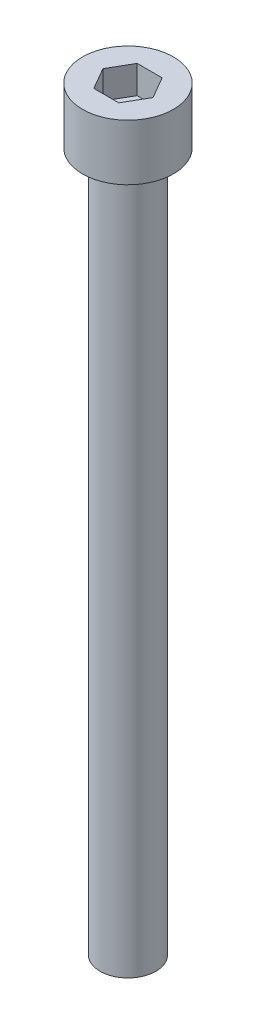
ISO-10303-21;
HEADER;
FILE_DESCRIPTION(('STEP AP214'),'2;1');
FILE_NAME('part.step','',(''),(''),'','','');
FILE_SCHEMA(('AUTOMOTIVE_DESIGN { 1 0 10303 214 1 1 1 1 }'));
ENDSEC;
DATA;
#1=APPLICATION_CONTEXT('core data for automotive mechanical design processes');
#2=APPLICATION_PROTOCOL_DEFINITION('international standard','automotive_design',2000,#1);
#3=PRODUCT_CONTEXT('',#1,'mechanical');
#4=PRODUCT('Part','Part','',(#3));
#5=PRODUCT_RELATED_PRODUCT_CATEGORY('part','',(#4));
#6=PRODUCT_DEFINITION_FORMATION('','',#4);
#7=PRODUCT_DEFINITION_CONTEXT('part definition',#1,'design');
#8=PRODUCT_DEFINITION('design','',#6,#7);
#9=PRODUCT_DEFINITION_SHAPE('','',#8);
#10=(LENGTH_UNIT() NAMED_UNIT(*) SI_UNIT(.MILLI.,.METRE.));
#11=(NAMED_UNIT(*) PLANE_ANGLE_UNIT() SI_UNIT($,.RADIAN.));
#12=(NAMED_UNIT(*) SI_UNIT($,.STERADIAN.) SOLID_ANGLE_UNIT());
#13=UNCERTAINTY_MEASURE_WITH_UNIT(LENGTH_MEASURE(1.E-05),#10,'distance_accuracy_value','');
#14=(GEOMETRIC_REPRESENTATION_CONTEXT(3) GLOBAL_UNCERTAINTY_ASSIGNED_CONTEXT((#13)) GLOBAL_UNIT_ASSIGNED_CONTEXT((#10,
#11,#12)) REPRESENTATION_CONTEXT('',''));
#15=CARTESIAN_POINT('',(0.,0.,0.));
#16=DIRECTION('',(0.,0.,1.));
#17=DIRECTION('',(1.,0.,0.));
#18=AXIS2_PLACEMENT_3D('',#15,#16,#17);
#19=CARTESIAN_POINT('',(0.,8.,0.));
#20=DIRECTION('',(0.,-1.,0.));
#21=DIRECTION('',(0.,0.,-1.));
#22=AXIS2_PLACEMENT_3D('',#19,#20,#21);
#23=CYLINDRICAL_SURFACE('',#22,6.5);
#24=CARTESIAN_POINT('',(0.,8.,0.));
#25=DIRECTION('',(0.,1.,0.));
#26=DIRECTION('',(0.,0.,1.));
#27=AXIS2_PLACEMENT_3D('',#24,#25,#26);
#28=CIRCLE('',#27,6.5);
#29=CARTESIAN_POINT('',(0.,8.,6.5));
#30=VERTEX_POINT('',#29);
#31=EDGE_CURVE('E45',#30,#30,#28,.T.);
#32=ORIENTED_EDGE('',*,*,#31,.F.);
#33=EDGE_LOOP('',(#32));
#34=FACE_BOUND('',#33,.T.);
#35=CARTESIAN_POINT('',(0.,0.,0.));
#36=DIRECTION('',(0.,1.,0.));
#37=DIRECTION('',(0.,0.,1.));
#38=AXIS2_PLACEMENT_3D('',#35,#36,#37);
#39=CIRCLE('',#38,6.5);
#40=CARTESIAN_POINT('',(0.,0.,6.5));
#41=VERTEX_POINT('',#40);
#42=EDGE_CURVE('E40',#41,#41,#39,.T.);
#43=ORIENTED_EDGE('',*,*,#42,.T.);
#44=EDGE_LOOP('',(#43));
#45=FACE_BOUND('',#44,.T.);
#46=ADVANCED_FACE('F37',(#34,#45),#23,.T.);
#47=CARTESIAN_POINT('',(0.,8.,0.));
#48=DIRECTION('',(0.,1.,0.));
#49=DIRECTION('',(0.,0.,1.));
#50=AXIS2_PLACEMENT_3D('',#47,#48,#49);
#51=PLANE('',#50);
#52=DIRECTION('',(0.5,0.,-0.866025403784439));
#53=VECTOR('',#52,1.);
#54=CARTESIAN_POINT('',(1.78978583448784,8.,3.1));
#55=LINE('',#54,#53);
#56=CARTESIAN_POINT('',(1.78978583448784,8.,3.1));
#57=VERTEX_POINT('',#56);
#58=CARTESIAN_POINT('',(3.57957166897568,8.,0.));
#59=VERTEX_POINT('',#58);
#60=EDGE_CURVE('E53',#57,#59,#55,.T.);
#61=ORIENTED_EDGE('',*,*,#60,.F.);
#62=DIRECTION('',(1.,0.,0.));
#63=VECTOR('',#62,1.);
#64=CARTESIAN_POINT('',(-1.78978583448784,8.,3.1));
#65=LINE('',#64,#63);
#66=CARTESIAN_POINT('',(-1.78978583448784,8.,3.1));
#67=VERTEX_POINT('',#66);
#68=EDGE_CURVE('E137',#67,#57,#65,.T.);
#69=ORIENTED_EDGE('',*,*,#68,.F.);
#70=DIRECTION('',(0.5,0.,0.866025403784439));
#71=VECTOR('',#70,1.);
#72=CARTESIAN_POINT('',(-3.57957166897568,8.,0.));
#73=LINE('',#72,#71);
#74=CARTESIAN_POINT('',(-3.57957166897568,8.,0.));
#75=VERTEX_POINT('',#74);
#76=EDGE_CURVE('E135',#75,#67,#73,.T.);
#77=ORIENTED_EDGE('',*,*,#76,.F.);
#78=DIRECTION('',(-0.5,0.,0.866025403784439));
#79=VECTOR('',#78,1.);
#80=CARTESIAN_POINT('',(-1.78978583448784,8.,-3.1));
#81=LINE('',#80,#79);
#82=CARTESIAN_POINT('',(-1.78978583448784,8.,-3.1));
#83=VERTEX_POINT('',#82);
#84=EDGE_CURVE('E101',#83,#75,#81,.T.);
#85=ORIENTED_EDGE('',*,*,#84,.F.);
#86=DIRECTION('',(-1.,0.,0.));
#87=VECTOR('',#86,1.);
#88=CARTESIAN_POINT('',(1.78978583448784,8.,-3.1));
#89=LINE('',#88,#87);
#90=CARTESIAN_POINT('',(1.78978583448784,8.,-3.1));
#91=VERTEX_POINT('',#90);
#92=EDGE_CURVE('E131',#91,#83,#89,.T.);
#93=ORIENTED_EDGE('',*,*,#92,.F.);
#94=DIRECTION('',(-0.5,0.,-0.866025403784439));
#95=VECTOR('',#94,1.);
#96=CARTESIAN_POINT('',(3.57957166897568,8.,0.));
#97=LINE('',#96,#95);
#98=EDGE_CURVE('E127',#59,#91,#97,.T.);
#99=ORIENTED_EDGE('',*,*,#98,.F.);
#100=EDGE_LOOP('',(#61,#69,#77,#85,#93,#99));
#101=FACE_BOUND('',#100,.T.);
#102=ORIENTED_EDGE('',*,*,#31,.T.);
#103=EDGE_LOOP('',(#102));
#104=FACE_BOUND('',#103,.T.);
#105=ADVANCED_FACE('F155',(#101,#104),#51,.T.);
#106=CARTESIAN_POINT('',(0.,0.,0.));
#107=DIRECTION('',(0.,1.,0.));
#108=DIRECTION('',(0.,0.,1.));
#109=AXIS2_PLACEMENT_3D('',#106,#107,#108);
#110=PLANE('',#109);
#111=CARTESIAN_POINT('',(0.,0.,0.));
#112=DIRECTION('',(0.,-1.,0.));
#113=DIRECTION('',(0.,0.,-1.));
#114=AXIS2_PLACEMENT_3D('',#111,#112,#113);
#115=CIRCLE('',#114,4.);
#116=CARTESIAN_POINT('',(0.,0.,-4.));
#117=VERTEX_POINT('',#116);
#118=EDGE_CURVE('E11',#117,#117,#115,.T.);
#119=ORIENTED_EDGE('',*,*,#118,.F.);
#120=EDGE_LOOP('',(#119));
#121=FACE_BOUND('',#120,.T.);
#122=ORIENTED_EDGE('',*,*,#42,.F.);
#123=EDGE_LOOP('',(#122));
#124=FACE_BOUND('',#123,.T.);
#125=ADVANCED_FACE('F152',(#121,#124),#110,.F.);
#126=CARTESIAN_POINT('',(1.78978583448784,4.,3.1));
#127=DIRECTION('',(0.866025403784439,0.,0.5));
#128=DIRECTION('',(0.5,0.,-0.866025403784439));
#129=AXIS2_PLACEMENT_3D('',#126,#127,#128);
#130=PLANE('',#129);
#131=ORIENTED_EDGE('',*,*,#60,.T.);
#132=DIRECTION('',(0.,1.,0.));
#133=VECTOR('',#132,1.);
#134=CARTESIAN_POINT('',(3.57957166897568,4.,0.));
#135=LINE('',#134,#133);
#136=CARTESIAN_POINT('',(3.57957166897568,4.,0.));
#137=VERTEX_POINT('',#136);
#138=EDGE_CURVE('E83',#137,#59,#135,.T.);
#139=ORIENTED_EDGE('',*,*,#138,.F.);
#140=DIRECTION('',(0.5,0.,-0.866025403784439));
#141=VECTOR('',#140,1.);
#142=CARTESIAN_POINT('',(1.78978583448784,4.,3.1));
#143=LINE('',#142,#141);
#144=CARTESIAN_POINT('',(1.78978583448784,4.,3.1));
#145=VERTEX_POINT('',#144);
#146=EDGE_CURVE('E139',#145,#137,#143,.T.);
#147=ORIENTED_EDGE('',*,*,#146,.F.);
#148=DIRECTION('',(0.,1.,0.));
#149=VECTOR('',#148,1.);
#150=CARTESIAN_POINT('',(1.78978583448784,4.,3.1));
#151=LINE('',#150,#149);
#152=EDGE_CURVE('E61',#145,#57,#151,.T.);
#153=ORIENTED_EDGE('',*,*,#152,.T.);
#154=EDGE_LOOP('',(#131,#139,#147,#153));
#155=FACE_BOUND('',#154,.T.);
#156=ADVANCED_FACE('F154',(#155),#130,.F.);
#157=CARTESIAN_POINT('',(-1.78978583448784,4.,3.1));
#158=DIRECTION('',(0.,0.,1.));
#159=DIRECTION('',(1.,0.,0.));
#160=AXIS2_PLACEMENT_3D('',#157,#158,#159);
#161=PLANE('',#160);
#162=ORIENTED_EDGE('',*,*,#68,.T.);
#163=ORIENTED_EDGE('',*,*,#152,.F.);
#164=DIRECTION('',(1.,0.,0.));
#165=VECTOR('',#164,1.);
#166=CARTESIAN_POINT('',(-1.78978583448784,4.,3.1));
#167=LINE('',#166,#165);
#168=CARTESIAN_POINT('',(-1.78978583448784,4.,3.1));
#169=VERTEX_POINT('',#168);
#170=EDGE_CURVE('E113',#169,#145,#167,.T.);
#171=ORIENTED_EDGE('',*,*,#170,.F.);
#172=DIRECTION('',(0.,1.,0.));
#173=VECTOR('',#172,1.);
#174=CARTESIAN_POINT('',(-1.78978583448784,4.,3.1));
#175=LINE('',#174,#173);
#176=EDGE_CURVE('E105',#169,#67,#175,.T.);
#177=ORIENTED_EDGE('',*,*,#176,.T.);
#178=EDGE_LOOP('',(#162,#163,#171,#177));
#179=FACE_BOUND('',#178,.T.);
#180=ADVANCED_FACE('F161',(#179),#161,.F.);
#181=CARTESIAN_POINT('',(-3.57957166897568,4.,0.));
#182=DIRECTION('',(-0.866025403784439,0.,0.5));
#183=DIRECTION('',(0.5,0.,0.866025403784439));
#184=AXIS2_PLACEMENT_3D('',#181,#182,#183);
#185=PLANE('',#184);
#186=ORIENTED_EDGE('',*,*,#76,.T.);
#187=ORIENTED_EDGE('',*,*,#176,.F.);
#188=DIRECTION('',(0.5,0.,0.866025403784439));
#189=VECTOR('',#188,1.);
#190=CARTESIAN_POINT('',(-3.57957166897568,4.,0.));
#191=LINE('',#190,#189);
#192=CARTESIAN_POINT('',(-3.57957166897568,4.,0.));
#193=VERTEX_POINT('',#192);
#194=EDGE_CURVE('E109',#193,#169,#191,.T.);
#195=ORIENTED_EDGE('',*,*,#194,.F.);
#196=DIRECTION('',(0.,1.,0.));
#197=VECTOR('',#196,1.);
#198=CARTESIAN_POINT('',(-3.57957166897568,4.,0.));
#199=LINE('',#198,#197);
#200=EDGE_CURVE('E94',#193,#75,#199,.T.);
#201=ORIENTED_EDGE('',*,*,#200,.T.);
#202=EDGE_LOOP('',(#186,#187,#195,#201));
#203=FACE_BOUND('',#202,.T.);
#204=ADVANCED_FACE('F110',(#203),#185,.F.);
#205=CARTESIAN_POINT('',(-1.78978583448784,4.,-3.1));
#206=DIRECTION('',(-0.866025403784439,0.,-0.5));
#207=DIRECTION('',(-0.5,0.,0.866025403784439));
#208=AXIS2_PLACEMENT_3D('',#205,#206,#207);
#209=PLANE('',#208);
#210=ORIENTED_EDGE('',*,*,#84,.T.);
#211=ORIENTED_EDGE('',*,*,#200,.F.);
#212=DIRECTION('',(-0.5,0.,0.866025403784439));
#213=VECTOR('',#212,1.);
#214=CARTESIAN_POINT('',(-1.78978583448784,4.,-3.1));
#215=LINE('',#214,#213);
#216=CARTESIAN_POINT('',(-1.78978583448784,4.,-3.1));
#217=VERTEX_POINT('',#216);
#218=EDGE_CURVE('E98',#217,#193,#215,.T.);
#219=ORIENTED_EDGE('',*,*,#218,.F.);
#220=DIRECTION('',(0.,1.,0.));
#221=VECTOR('',#220,1.);
#222=CARTESIAN_POINT('',(-1.78978583448784,4.,-3.1));
#223=LINE('',#222,#221);
#224=EDGE_CURVE('E106',#217,#83,#223,.T.);
#225=ORIENTED_EDGE('',*,*,#224,.T.);
#226=EDGE_LOOP('',(#210,#211,#219,#225));
#227=FACE_BOUND('',#226,.T.);
#228=ADVANCED_FACE('F96',(#227),#209,.F.);
#229=CARTESIAN_POINT('',(1.78978583448784,4.,-3.1));
#230=DIRECTION('',(0.,0.,-1.));
#231=DIRECTION('',(-1.,0.,0.));
#232=AXIS2_PLACEMENT_3D('',#229,#230,#231);
#233=PLANE('',#232);
#234=ORIENTED_EDGE('',*,*,#92,.T.);
#235=ORIENTED_EDGE('',*,*,#224,.F.);
#236=DIRECTION('',(-1.,0.,0.));
#237=VECTOR('',#236,1.);
#238=CARTESIAN_POINT('',(1.78978583448784,4.,-3.1));
#239=LINE('',#238,#237);
#240=CARTESIAN_POINT('',(1.78978583448784,4.,-3.1));
#241=VERTEX_POINT('',#240);
#242=EDGE_CURVE('E119',#241,#217,#239,.T.);
#243=ORIENTED_EDGE('',*,*,#242,.F.);
#244=DIRECTION('',(0.,1.,0.));
#245=VECTOR('',#244,1.);
#246=CARTESIAN_POINT('',(1.78978583448784,4.,-3.1));
#247=LINE('',#246,#245);
#248=EDGE_CURVE('E143',#241,#91,#247,.T.);
#249=ORIENTED_EDGE('',*,*,#248,.T.);
#250=EDGE_LOOP('',(#234,#235,#243,#249));
#251=FACE_BOUND('',#250,.T.);
#252=ADVANCED_FACE('F206',(#251),#233,.F.);
#253=CARTESIAN_POINT('',(3.57957166897568,4.,0.));
#254=DIRECTION('',(0.866025403784439,0.,-0.5));
#255=DIRECTION('',(-0.5,0.,-0.866025403784439));
#256=AXIS2_PLACEMENT_3D('',#253,#254,#255);
#257=PLANE('',#256);
#258=ORIENTED_EDGE('',*,*,#98,.T.);
#259=ORIENTED_EDGE('',*,*,#248,.F.);
#260=DIRECTION('',(-0.5,0.,-0.866025403784439));
#261=VECTOR('',#260,1.);
#262=CARTESIAN_POINT('',(3.57957166897568,4.,0.));
#263=LINE('',#262,#261);
#264=EDGE_CURVE('E121',#137,#241,#263,.T.);
#265=ORIENTED_EDGE('',*,*,#264,.F.);
#266=ORIENTED_EDGE('',*,*,#138,.T.);
#267=EDGE_LOOP('',(#258,#259,#265,#266));
#268=FACE_BOUND('',#267,.T.);
#269=ADVANCED_FACE('F215',(#268),#257,.F.);
#270=CARTESIAN_POINT('',(0.,4.,0.));
#271=DIRECTION('',(0.,1.,0.));
#272=DIRECTION('',(0.,0.,1.));
#273=AXIS2_PLACEMENT_3D('',#270,#271,#272);
#274=PLANE('',#273);
#275=ORIENTED_EDGE('',*,*,#146,.T.);
#276=ORIENTED_EDGE('',*,*,#264,.T.);
#277=ORIENTED_EDGE('',*,*,#242,.T.);
#278=ORIENTED_EDGE('',*,*,#218,.T.);
#279=ORIENTED_EDGE('',*,*,#194,.T.);
#280=ORIENTED_EDGE('',*,*,#170,.T.);
#281=EDGE_LOOP('',(#275,#276,#277,#278,#279,#280));
#282=FACE_BOUND('',#281,.T.);
#283=ADVANCED_FACE('F116',(#282),#274,.T.);
#284=CARTESIAN_POINT('',(0.,-100.,0.));
#285=DIRECTION('',(0.,1.,0.));
#286=DIRECTION('',(0.,0.,1.));
#287=AXIS2_PLACEMENT_3D('',#284,#285,#286);
#288=CYLINDRICAL_SURFACE('',#287,4.);
#289=CARTESIAN_POINT('',(0.,-100.,0.));
#290=DIRECTION('',(0.,-1.,0.));
#291=DIRECTION('',(0.,0.,-1.));
#292=AXIS2_PLACEMENT_3D('',#289,#290,#291);
#293=CIRCLE('',#292,4.);
#294=CARTESIAN_POINT('',(0.,-100.,-4.));
#295=VERTEX_POINT('',#294);
#296=EDGE_CURVE('E128',#295,#295,#293,.T.);
#297=ORIENTED_EDGE('',*,*,#296,.F.);
#298=EDGE_LOOP('',(#297));
#299=FACE_BOUND('',#298,.T.);
#300=ORIENTED_EDGE('',*,*,#118,.T.);
#301=EDGE_LOOP('',(#300));
#302=FACE_BOUND('',#301,.T.);
#303=ADVANCED_FACE('F233',(#299,#302),#288,.T.);
#304=CARTESIAN_POINT('',(0.,-100.,0.));
#305=DIRECTION('',(0.,-1.,0.));
#306=DIRECTION('',(0.,0.,-1.));
#307=AXIS2_PLACEMENT_3D('',#304,#305,#306);
#308=PLANE('',#307);
#309=ORIENTED_EDGE('',*,*,#296,.T.);
#310=EDGE_LOOP('',(#309));
#311=FACE_BOUND('',#310,.T.);
#312=ADVANCED_FACE('F247',(#311),#308,.T.);
#313=CLOSED_SHELL('',(#46,#105,#125,#156,#180,#204,#228,#252,#269,#283,#303,#312));
#314=MANIFOLD_SOLID_BREP('B2',#313);
#315=ADVANCED_BREP_SHAPE_REPRESENTATION('',(#18,#314),#14);
#316=SHAPE_DEFINITION_REPRESENTATION(#9,#315);
ENDSEC;
END-ISO-10303-21;
